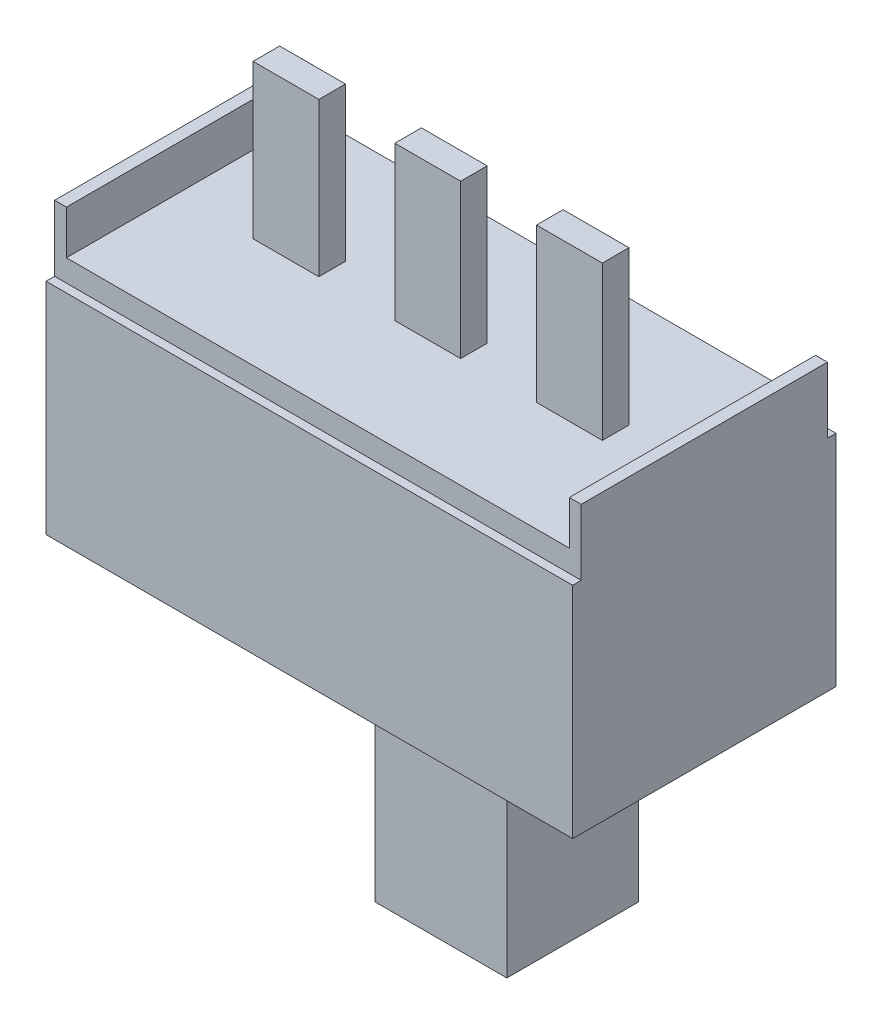
ISO-10303-21;
HEADER;
FILE_DESCRIPTION(('STEP AP214'),'2;1');
FILE_NAME('part.step','',(''),(''),'','','');
FILE_SCHEMA(('AUTOMOTIVE_DESIGN { 1 0 10303 214 1 1 1 1 }'));
ENDSEC;
DATA;
#1=APPLICATION_CONTEXT('core data for automotive mechanical design processes');
#2=APPLICATION_PROTOCOL_DEFINITION('international standard','automotive_design',2000,#1);
#3=PRODUCT_CONTEXT('',#1,'mechanical');
#4=PRODUCT('Part','Part','',(#3));
#5=PRODUCT_RELATED_PRODUCT_CATEGORY('part','',(#4));
#6=PRODUCT_DEFINITION_FORMATION('','',#4);
#7=PRODUCT_DEFINITION_CONTEXT('part definition',#1,'design');
#8=PRODUCT_DEFINITION('design','',#6,#7);
#9=PRODUCT_DEFINITION_SHAPE('','',#8);
#10=(LENGTH_UNIT() NAMED_UNIT(*) SI_UNIT(.MILLI.,.METRE.));
#11=(NAMED_UNIT(*) PLANE_ANGLE_UNIT() SI_UNIT($,.RADIAN.));
#12=(NAMED_UNIT(*) SI_UNIT($,.STERADIAN.) SOLID_ANGLE_UNIT());
#13=UNCERTAINTY_MEASURE_WITH_UNIT(LENGTH_MEASURE(1.E-05),#10,'distance_accuracy_value','');
#14=(GEOMETRIC_REPRESENTATION_CONTEXT(3) GLOBAL_UNCERTAINTY_ASSIGNED_CONTEXT((#13)) GLOBAL_UNIT_ASSIGNED_CONTEXT((#10,
#11,#12)) REPRESENTATION_CONTEXT('',''));
#15=CARTESIAN_POINT('',(0.,0.,0.));
#16=DIRECTION('',(0.,0.,1.));
#17=DIRECTION('',(1.,0.,0.));
#18=AXIS2_PLACEMENT_3D('',#15,#16,#17);
#19=CARTESIAN_POINT('',(3.,5.,1.5));
#20=DIRECTION('',(0.,0.,-1.));
#21=DIRECTION('',(-1.,0.,0.));
#22=AXIS2_PLACEMENT_3D('',#19,#20,#21);
#23=PLANE('',#22);
#24=DIRECTION('',(-1.,0.,0.));
#25=VECTOR('',#24,1.);
#26=CARTESIAN_POINT('',(3.,0.5,1.5));
#27=LINE('',#26,#25);
#28=CARTESIAN_POINT('',(0.,0.5,1.5));
#29=VERTEX_POINT('',#28);
#30=CARTESIAN_POINT('',(-3.,0.5,1.5));
#31=VERTEX_POINT('',#30);
#32=EDGE_CURVE('E62',#29,#31,#27,.T.);
#33=ORIENTED_EDGE('',*,*,#32,.F.);
#34=DIRECTION('',(0.,1.,0.));
#35=VECTOR('',#34,1.);
#36=CARTESIAN_POINT('',(0.,-5.,1.5));
#37=LINE('',#36,#35);
#38=CARTESIAN_POINT('',(0.,0.,1.5));
#39=VERTEX_POINT('',#38);
#40=EDGE_CURVE('E55',#39,#29,#37,.T.);
#41=ORIENTED_EDGE('',*,*,#40,.F.);
#42=DIRECTION('',(1.,0.,0.));
#43=VECTOR('',#42,1.);
#44=CARTESIAN_POINT('',(3.,0.,1.5));
#45=LINE('',#44,#43);
#46=CARTESIAN_POINT('',(-3.,0.,1.5));
#47=VERTEX_POINT('',#46);
#48=EDGE_CURVE('E505',#47,#39,#45,.T.);
#49=ORIENTED_EDGE('',*,*,#48,.F.);
#50=DIRECTION('',(0.,-1.,0.));
#51=VECTOR('',#50,1.);
#52=CARTESIAN_POINT('',(-3.,5.,1.5));
#53=LINE('',#52,#51);
#54=EDGE_CURVE('E520',#31,#47,#53,.T.);
#55=ORIENTED_EDGE('',*,*,#54,.F.);
#56=EDGE_LOOP('',(#33,#41,#49,#55));
#57=FACE_BOUND('',#56,.T.);
#58=ADVANCED_FACE('F39',(#57),#23,.T.);
#59=CARTESIAN_POINT('',(3.,5.,-1.5));
#60=DIRECTION('',(0.,0.,1.));
#61=DIRECTION('',(1.,0.,0.));
#62=AXIS2_PLACEMENT_3D('',#59,#60,#61);
#63=PLANE('',#62);
#64=DIRECTION('',(-1.,0.,0.));
#65=VECTOR('',#64,1.);
#66=CARTESIAN_POINT('',(3.,0.,-1.5));
#67=LINE('',#66,#65);
#68=CARTESIAN_POINT('',(0.,0.,-1.5));
#69=VERTEX_POINT('',#68);
#70=CARTESIAN_POINT('',(-3.,0.,-1.5));
#71=VERTEX_POINT('',#70);
#72=EDGE_CURVE('E511',#69,#71,#67,.T.);
#73=ORIENTED_EDGE('',*,*,#72,.F.);
#74=DIRECTION('',(0.,1.,0.));
#75=VECTOR('',#74,1.);
#76=CARTESIAN_POINT('',(0.,-5.,-1.5));
#77=LINE('',#76,#75);
#78=CARTESIAN_POINT('',(0.,0.5,-1.5));
#79=VERTEX_POINT('',#78);
#80=EDGE_CURVE('E614',#69,#79,#77,.T.);
#81=ORIENTED_EDGE('',*,*,#80,.T.);
#82=DIRECTION('',(1.,0.,0.));
#83=VECTOR('',#82,1.);
#84=CARTESIAN_POINT('',(-3.,0.5,-1.5));
#85=LINE('',#84,#83);
#86=CARTESIAN_POINT('',(-3.,0.5,-1.5));
#87=VERTEX_POINT('',#86);
#88=EDGE_CURVE('E285',#87,#79,#85,.T.);
#89=ORIENTED_EDGE('',*,*,#88,.F.);
#90=DIRECTION('',(0.,-1.,0.));
#91=VECTOR('',#90,1.);
#92=CARTESIAN_POINT('',(-3.,5.,-1.5));
#93=LINE('',#92,#91);
#94=EDGE_CURVE('E516',#87,#71,#93,.T.);
#95=ORIENTED_EDGE('',*,*,#94,.T.);
#96=EDGE_LOOP('',(#73,#81,#89,#95));
#97=FACE_BOUND('',#96,.T.);
#98=ADVANCED_FACE('F595',(#97),#63,.T.);
#99=CARTESIAN_POINT('',(0.,0.5,0.));
#100=DIRECTION('',(0.,-1.,0.));
#101=DIRECTION('',(0.,0.,-1.));
#102=AXIS2_PLACEMENT_3D('',#99,#100,#101);
#103=PLANE('',#102);
#104=ORIENTED_EDGE('',*,*,#88,.T.);
#105=DIRECTION('',(0.,0.,-1.));
#106=VECTOR('',#105,1.);
#107=CARTESIAN_POINT('',(0.,0.5,1.5));
#108=LINE('',#107,#106);
#109=EDGE_CURVE('E266',#29,#79,#108,.T.);
#110=ORIENTED_EDGE('',*,*,#109,.F.);
#111=ORIENTED_EDGE('',*,*,#32,.T.);
#112=DIRECTION('',(0.,0.,-1.));
#113=VECTOR('',#112,1.);
#114=CARTESIAN_POINT('',(-3.,0.5,1.5));
#115=LINE('',#114,#113);
#116=EDGE_CURVE('E282',#31,#87,#115,.T.);
#117=ORIENTED_EDGE('',*,*,#116,.T.);
#118=EDGE_LOOP('',(#104,#110,#111,#117));
#119=FACE_BOUND('',#118,.T.);
#120=ADVANCED_FACE('F619',(#119),#103,.T.);
#121=CARTESIAN_POINT('',(0.,5.,0.));
#122=DIRECTION('',(0.,1.,0.));
#123=DIRECTION('',(0.,0.,1.));
#124=AXIS2_PLACEMENT_3D('',#121,#122,#123);
#125=PLANE('',#124);
#126=DIRECTION('',(0.,0.,-1.));
#127=VECTOR('',#126,1.);
#128=CARTESIAN_POINT('',(6.,5.,3.));
#129=LINE('',#128,#127);
#130=CARTESIAN_POINT('',(6.,5.,3.));
#131=VERTEX_POINT('',#130);
#132=CARTESIAN_POINT('',(6.,5.,2.8051113903814));
#133=VERTEX_POINT('',#132);
#134=EDGE_CURVE('E533',#131,#133,#129,.T.);
#135=ORIENTED_EDGE('',*,*,#134,.T.);
#136=DIRECTION('',(-1.,0.,0.));
#137=VECTOR('',#136,1.);
#138=CARTESIAN_POINT('',(0.,5.,2.8051113903814));
#139=LINE('',#138,#137);
#140=CARTESIAN_POINT('',(-6.,5.,2.8051113903814));
#141=VERTEX_POINT('',#140);
#142=EDGE_CURVE('E438',#133,#141,#139,.T.);
#143=ORIENTED_EDGE('',*,*,#142,.T.);
#144=DIRECTION('',(0.,0.,1.));
#145=VECTOR('',#144,1.);
#146=CARTESIAN_POINT('',(-6.,5.,3.));
#147=LINE('',#146,#145);
#148=CARTESIAN_POINT('',(-6.,5.,3.));
#149=VERTEX_POINT('',#148);
#150=EDGE_CURVE('E529',#141,#149,#147,.T.);
#151=ORIENTED_EDGE('',*,*,#150,.T.);
#152=DIRECTION('',(1.,0.,0.));
#153=VECTOR('',#152,1.);
#154=CARTESIAN_POINT('',(6.,5.,3.));
#155=LINE('',#154,#153);
#156=EDGE_CURVE('E528',#149,#131,#155,.T.);
#157=ORIENTED_EDGE('',*,*,#156,.T.);
#158=EDGE_LOOP('',(#135,#143,#151,#157));
#159=FACE_BOUND('',#158,.T.);
#160=ADVANCED_FACE('F621',(#159),#125,.T.);
#161=DIRECTION('',(-1.,0.,0.));
#162=VECTOR('',#161,1.);
#163=CARTESIAN_POINT('',(0.,5.,-2.8051113903814));
#164=LINE('',#163,#162);
#165=CARTESIAN_POINT('',(6.,5.,-2.8051113903814));
#166=VERTEX_POINT('',#165);
#167=CARTESIAN_POINT('',(-6.,5.,-2.8051113903814));
#168=VERTEX_POINT('',#167);
#169=EDGE_CURVE('E444',#166,#168,#164,.T.);
#170=ORIENTED_EDGE('',*,*,#169,.F.);
#171=CARTESIAN_POINT('',(6.,5.,-3.));
#172=VERTEX_POINT('',#171);
#173=EDGE_CURVE('E532',#166,#172,#129,.T.);
#174=ORIENTED_EDGE('',*,*,#173,.T.);
#175=DIRECTION('',(-1.,0.,0.));
#176=VECTOR('',#175,1.);
#177=CARTESIAN_POINT('',(6.,5.,-3.));
#178=LINE('',#177,#176);
#179=CARTESIAN_POINT('',(-6.,5.,-3.));
#180=VERTEX_POINT('',#179);
#181=EDGE_CURVE('E537',#172,#180,#178,.T.);
#182=ORIENTED_EDGE('',*,*,#181,.T.);
#183=EDGE_CURVE('E524',#180,#168,#147,.T.);
#184=ORIENTED_EDGE('',*,*,#183,.T.);
#185=EDGE_LOOP('',(#170,#174,#182,#184));
#186=FACE_BOUND('',#185,.T.);
#187=ADVANCED_FACE('F584',(#186),#125,.T.);
#188=CARTESIAN_POINT('',(0.,0.,0.));
#189=DIRECTION('',(0.,1.,0.));
#190=DIRECTION('',(0.,0.,1.));
#191=AXIS2_PLACEMENT_3D('',#188,#189,#190);
#192=PLANE('',#191);
#193=DIRECTION('',(0.,0.,1.));
#194=VECTOR('',#193,1.);
#195=CARTESIAN_POINT('',(-6.,0.,3.));
#196=LINE('',#195,#194);
#197=CARTESIAN_POINT('',(-6.,0.,-3.));
#198=VERTEX_POINT('',#197);
#199=CARTESIAN_POINT('',(-6.,0.,3.));
#200=VERTEX_POINT('',#199);
#201=EDGE_CURVE('E523',#198,#200,#196,.T.);
#202=ORIENTED_EDGE('',*,*,#201,.F.);
#203=DIRECTION('',(-1.,0.,0.));
#204=VECTOR('',#203,1.);
#205=CARTESIAN_POINT('',(6.,0.,-3.));
#206=LINE('',#205,#204);
#207=CARTESIAN_POINT('',(6.,0.,-3.));
#208=VERTEX_POINT('',#207);
#209=EDGE_CURVE('E550',#208,#198,#206,.T.);
#210=ORIENTED_EDGE('',*,*,#209,.F.);
#211=DIRECTION('',(0.,0.,-1.));
#212=VECTOR('',#211,1.);
#213=CARTESIAN_POINT('',(6.,0.,3.));
#214=LINE('',#213,#212);
#215=CARTESIAN_POINT('',(6.,0.,3.));
#216=VERTEX_POINT('',#215);
#217=EDGE_CURVE('E547',#216,#208,#214,.T.);
#218=ORIENTED_EDGE('',*,*,#217,.F.);
#219=DIRECTION('',(1.,0.,0.));
#220=VECTOR('',#219,1.);
#221=CARTESIAN_POINT('',(6.,0.,3.));
#222=LINE('',#221,#220);
#223=EDGE_CURVE('E544',#200,#216,#222,.T.);
#224=ORIENTED_EDGE('',*,*,#223,.F.);
#225=EDGE_LOOP('',(#202,#210,#218,#224));
#226=FACE_BOUND('',#225,.T.);
#227=DIRECTION('',(0.,0.,1.));
#228=VECTOR('',#227,1.);
#229=CARTESIAN_POINT('',(-3.,0.,1.5));
#230=LINE('',#229,#228);
#231=EDGE_CURVE('E497',#71,#47,#230,.T.);
#232=ORIENTED_EDGE('',*,*,#231,.T.);
#233=ORIENTED_EDGE('',*,*,#48,.T.);
#234=DIRECTION('',(-1.,0.,0.));
#235=VECTOR('',#234,1.);
#236=CARTESIAN_POINT('',(0.,0.,1.5));
#237=LINE('',#236,#235);
#238=CARTESIAN_POINT('',(3.,0.,1.5));
#239=VERTEX_POINT('',#238);
#240=EDGE_CURVE('E272',#239,#39,#237,.T.);
#241=ORIENTED_EDGE('',*,*,#240,.F.);
#242=DIRECTION('',(0.,0.,-1.));
#243=VECTOR('',#242,1.);
#244=CARTESIAN_POINT('',(3.,0.,1.5));
#245=LINE('',#244,#243);
#246=CARTESIAN_POINT('',(3.,0.,-1.5));
#247=VERTEX_POINT('',#246);
#248=EDGE_CURVE('E270',#239,#247,#245,.T.);
#249=ORIENTED_EDGE('',*,*,#248,.T.);
#250=EDGE_CURVE('E512',#247,#69,#67,.T.);
#251=ORIENTED_EDGE('',*,*,#250,.T.);
#252=ORIENTED_EDGE('',*,*,#72,.T.);
#253=EDGE_LOOP('',(#232,#233,#241,#249,#251,#252));
#254=FACE_BOUND('',#253,.T.);
#255=ADVANCED_FACE('F572',(#226,#254),#192,.F.);
#256=CARTESIAN_POINT('',(-6.,5.,3.));
#257=DIRECTION('',(1.,0.,0.));
#258=DIRECTION('',(0.,0.,-1.));
#259=AXIS2_PLACEMENT_3D('',#256,#257,#258);
#260=PLANE('',#259);
#261=ORIENTED_EDGE('',*,*,#201,.T.);
#262=DIRECTION('',(0.,-1.,0.));
#263=VECTOR('',#262,1.);
#264=CARTESIAN_POINT('',(-6.,5.,3.));
#265=LINE('',#264,#263);
#266=EDGE_CURVE('E11',#149,#200,#265,.T.);
#267=ORIENTED_EDGE('',*,*,#266,.F.);
#268=ORIENTED_EDGE('',*,*,#150,.F.);
#269=DIRECTION('',(0.,-1.,0.));
#270=VECTOR('',#269,1.);
#271=CARTESIAN_POINT('',(-6.,6.5,2.8051113903814));
#272=LINE('',#271,#270);
#273=CARTESIAN_POINT('',(-6.,6.5,2.8051113903814));
#274=VERTEX_POINT('',#273);
#275=EDGE_CURVE('E434',#274,#141,#272,.T.);
#276=ORIENTED_EDGE('',*,*,#275,.F.);
#277=DIRECTION('',(0.,0.,1.));
#278=VECTOR('',#277,1.);
#279=CARTESIAN_POINT('',(-6.,6.5,0.));
#280=LINE('',#279,#278);
#281=CARTESIAN_POINT('',(-6.,6.5,-2.8051113903814));
#282=VERTEX_POINT('',#281);
#283=EDGE_CURVE('E409',#282,#274,#280,.T.);
#284=ORIENTED_EDGE('',*,*,#283,.F.);
#285=DIRECTION('',(0.,-1.,0.));
#286=VECTOR('',#285,1.);
#287=CARTESIAN_POINT('',(-6.,6.5,-2.8051113903814));
#288=LINE('',#287,#286);
#289=EDGE_CURVE('E422',#282,#168,#288,.T.);
#290=ORIENTED_EDGE('',*,*,#289,.T.);
#291=ORIENTED_EDGE('',*,*,#183,.F.);
#292=DIRECTION('',(0.,-1.,0.));
#293=VECTOR('',#292,1.);
#294=CARTESIAN_POINT('',(-6.,5.,-3.));
#295=LINE('',#294,#293);
#296=EDGE_CURVE('E540',#180,#198,#295,.T.);
#297=ORIENTED_EDGE('',*,*,#296,.T.);
#298=EDGE_LOOP('',(#261,#267,#268,#276,#284,#290,#291,#297));
#299=FACE_BOUND('',#298,.T.);
#300=ADVANCED_FACE('F41',(#299),#260,.F.);
#301=CARTESIAN_POINT('',(6.,5.,3.));
#302=DIRECTION('',(0.,0.,-1.));
#303=DIRECTION('',(-1.,0.,0.));
#304=AXIS2_PLACEMENT_3D('',#301,#302,#303);
#305=PLANE('',#304);
#306=ORIENTED_EDGE('',*,*,#223,.T.);
#307=DIRECTION('',(0.,-1.,0.));
#308=VECTOR('',#307,1.);
#309=CARTESIAN_POINT('',(6.,5.,3.));
#310=LINE('',#309,#308);
#311=EDGE_CURVE('E48',#131,#216,#310,.T.);
#312=ORIENTED_EDGE('',*,*,#311,.F.);
#313=ORIENTED_EDGE('',*,*,#156,.F.);
#314=ORIENTED_EDGE('',*,*,#266,.T.);
#315=EDGE_LOOP('',(#306,#312,#313,#314));
#316=FACE_BOUND('',#315,.T.);
#317=ADVANCED_FACE('F646',(#316),#305,.F.);
#318=CARTESIAN_POINT('',(6.,5.,3.));
#319=DIRECTION('',(-1.,0.,0.));
#320=DIRECTION('',(0.,0.,1.));
#321=AXIS2_PLACEMENT_3D('',#318,#319,#320);
#322=PLANE('',#321);
#323=ORIENTED_EDGE('',*,*,#217,.T.);
#324=DIRECTION('',(0.,-1.,0.));
#325=VECTOR('',#324,1.);
#326=CARTESIAN_POINT('',(6.,5.,-3.));
#327=LINE('',#326,#325);
#328=EDGE_CURVE('E556',#172,#208,#327,.T.);
#329=ORIENTED_EDGE('',*,*,#328,.F.);
#330=ORIENTED_EDGE('',*,*,#173,.F.);
#331=DIRECTION('',(0.,-1.,0.));
#332=VECTOR('',#331,1.);
#333=CARTESIAN_POINT('',(6.,6.5,-2.8051113903814));
#334=LINE('',#333,#332);
#335=CARTESIAN_POINT('',(6.,6.5,-2.8051113903814));
#336=VERTEX_POINT('',#335);
#337=EDGE_CURVE('E401',#336,#166,#334,.T.);
#338=ORIENTED_EDGE('',*,*,#337,.F.);
#339=DIRECTION('',(0.,0.,-1.));
#340=VECTOR('',#339,1.);
#341=CARTESIAN_POINT('',(6.,6.5,0.));
#342=LINE('',#341,#340);
#343=CARTESIAN_POINT('',(6.,6.5,2.8051113903814));
#344=VERTEX_POINT('',#343);
#345=EDGE_CURVE('E383',#344,#336,#342,.T.);
#346=ORIENTED_EDGE('',*,*,#345,.F.);
#347=DIRECTION('',(0.,-1.,0.));
#348=VECTOR('',#347,1.);
#349=CARTESIAN_POINT('',(6.,6.5,2.8051113903814));
#350=LINE('',#349,#348);
#351=EDGE_CURVE('E405',#344,#133,#350,.T.);
#352=ORIENTED_EDGE('',*,*,#351,.T.);
#353=ORIENTED_EDGE('',*,*,#134,.F.);
#354=ORIENTED_EDGE('',*,*,#311,.T.);
#355=EDGE_LOOP('',(#323,#329,#330,#338,#346,#352,#353,#354));
#356=FACE_BOUND('',#355,.T.);
#357=ADVANCED_FACE('F565',(#356),#322,.F.);
#358=CARTESIAN_POINT('',(6.,5.,-3.));
#359=DIRECTION('',(0.,0.,1.));
#360=DIRECTION('',(1.,0.,0.));
#361=AXIS2_PLACEMENT_3D('',#358,#359,#360);
#362=PLANE('',#361);
#363=ORIENTED_EDGE('',*,*,#209,.T.);
#364=ORIENTED_EDGE('',*,*,#296,.F.);
#365=ORIENTED_EDGE('',*,*,#181,.F.);
#366=ORIENTED_EDGE('',*,*,#328,.T.);
#367=EDGE_LOOP('',(#363,#364,#365,#366));
#368=FACE_BOUND('',#367,.T.);
#369=ADVANCED_FACE('F576',(#368),#362,.F.);
#370=CARTESIAN_POINT('',(-3.,5.,1.5));
#371=DIRECTION('',(1.,0.,0.));
#372=DIRECTION('',(0.,0.,-1.));
#373=AXIS2_PLACEMENT_3D('',#370,#371,#372);
#374=PLANE('',#373);
#375=ORIENTED_EDGE('',*,*,#116,.F.);
#376=ORIENTED_EDGE('',*,*,#54,.T.);
#377=ORIENTED_EDGE('',*,*,#231,.F.);
#378=ORIENTED_EDGE('',*,*,#94,.F.);
#379=EDGE_LOOP('',(#375,#376,#377,#378));
#380=FACE_BOUND('',#379,.T.);
#381=ADVANCED_FACE('F597',(#380),#374,.T.);
#382=CARTESIAN_POINT('',(0.,5.5,2.8051113903814));
#383=DIRECTION('',(0.,0.,1.));
#384=DIRECTION('',(1.,0.,0.));
#385=AXIS2_PLACEMENT_3D('',#382,#383,#384);
#386=PLANE('',#385);
#387=ORIENTED_EDGE('',*,*,#142,.F.);
#388=ORIENTED_EDGE('',*,*,#351,.F.);
#389=DIRECTION('',(-1.,0.,0.));
#390=VECTOR('',#389,1.);
#391=CARTESIAN_POINT('',(0.,6.5,2.8051113903814));
#392=LINE('',#391,#390);
#393=CARTESIAN_POINT('',(5.73001401451571,6.5,2.8051113903814));
#394=VERTEX_POINT('',#393);
#395=EDGE_CURVE('E379',#344,#394,#392,.T.);
#396=ORIENTED_EDGE('',*,*,#395,.T.);
#397=DIRECTION('',(0.,-1.,0.));
#398=VECTOR('',#397,1.);
#399=CARTESIAN_POINT('',(5.73001401451571,6.5,2.8051113903814));
#400=LINE('',#399,#398);
#401=CARTESIAN_POINT('',(5.73001401451571,5.5,2.8051113903814));
#402=VERTEX_POINT('',#401);
#403=EDGE_CURVE('E394',#394,#402,#400,.T.);
#404=ORIENTED_EDGE('',*,*,#403,.T.);
#405=DIRECTION('',(-1.,0.,0.));
#406=VECTOR('',#405,1.);
#407=CARTESIAN_POINT('',(0.,5.5,2.8051113903814));
#408=LINE('',#407,#406);
#409=CARTESIAN_POINT('',(-5.73001401451571,5.5,2.8051113903814));
#410=VERTEX_POINT('',#409);
#411=EDGE_CURVE('E458',#402,#410,#408,.T.);
#412=ORIENTED_EDGE('',*,*,#411,.T.);
#413=DIRECTION('',(0.,-1.,0.));
#414=VECTOR('',#413,1.);
#415=CARTESIAN_POINT('',(-5.73001401451571,6.5,2.8051113903814));
#416=LINE('',#415,#414);
#417=CARTESIAN_POINT('',(-5.73001401451571,6.5,2.8051113903814));
#418=VERTEX_POINT('',#417);
#419=EDGE_CURVE('E430',#418,#410,#416,.T.);
#420=ORIENTED_EDGE('',*,*,#419,.F.);
#421=DIRECTION('',(1.,0.,0.));
#422=VECTOR('',#421,1.);
#423=CARTESIAN_POINT('',(0.,6.5,2.8051113903814));
#424=LINE('',#423,#422);
#425=EDGE_CURVE('E413',#274,#418,#424,.T.);
#426=ORIENTED_EDGE('',*,*,#425,.F.);
#427=ORIENTED_EDGE('',*,*,#275,.T.);
#428=EDGE_LOOP('',(#387,#388,#396,#404,#412,#420,#426,#427));
#429=FACE_BOUND('',#428,.T.);
#430=ADVANCED_FACE('F639',(#429),#386,.T.);
#431=CARTESIAN_POINT('',(0.,5.5,-2.8051113903814));
#432=DIRECTION('',(0.,0.,1.));
#433=DIRECTION('',(1.,0.,0.));
#434=AXIS2_PLACEMENT_3D('',#431,#432,#433);
#435=PLANE('',#434);
#436=ORIENTED_EDGE('',*,*,#169,.T.);
#437=ORIENTED_EDGE('',*,*,#289,.F.);
#438=DIRECTION('',(-1.,0.,0.));
#439=VECTOR('',#438,1.);
#440=CARTESIAN_POINT('',(0.,6.5,-2.8051113903814));
#441=LINE('',#440,#439);
#442=CARTESIAN_POINT('',(-5.73001401451571,6.5,-2.8051113903814));
#443=VERTEX_POINT('',#442);
#444=EDGE_CURVE('E419',#443,#282,#441,.T.);
#445=ORIENTED_EDGE('',*,*,#444,.F.);
#446=DIRECTION('',(0.,-1.,0.));
#447=VECTOR('',#446,1.);
#448=CARTESIAN_POINT('',(-5.73001401451571,6.5,-2.8051113903814));
#449=LINE('',#448,#447);
#450=CARTESIAN_POINT('',(-5.73001401451571,5.5,-2.8051113903814));
#451=VERTEX_POINT('',#450);
#452=EDGE_CURVE('E426',#443,#451,#449,.T.);
#453=ORIENTED_EDGE('',*,*,#452,.T.);
#454=DIRECTION('',(-1.,0.,0.));
#455=VECTOR('',#454,1.);
#456=CARTESIAN_POINT('',(0.,5.5,-2.8051113903814));
#457=LINE('',#456,#455);
#458=CARTESIAN_POINT('',(5.73001401451571,5.5,-2.8051113903814));
#459=VERTEX_POINT('',#458);
#460=EDGE_CURVE('E466',#459,#451,#457,.T.);
#461=ORIENTED_EDGE('',*,*,#460,.F.);
#462=DIRECTION('',(0.,-1.,0.));
#463=VECTOR('',#462,1.);
#464=CARTESIAN_POINT('',(5.73001401451571,6.5,-2.8051113903814));
#465=LINE('',#464,#463);
#466=CARTESIAN_POINT('',(5.73001401451571,6.5,-2.8051113903814));
#467=VERTEX_POINT('',#466);
#468=EDGE_CURVE('E398',#467,#459,#465,.T.);
#469=ORIENTED_EDGE('',*,*,#468,.F.);
#470=DIRECTION('',(1.,0.,0.));
#471=VECTOR('',#470,1.);
#472=CARTESIAN_POINT('',(0.,6.5,-2.8051113903814));
#473=LINE('',#472,#471);
#474=EDGE_CURVE('E386',#467,#336,#473,.T.);
#475=ORIENTED_EDGE('',*,*,#474,.T.);
#476=ORIENTED_EDGE('',*,*,#337,.T.);
#477=EDGE_LOOP('',(#436,#437,#445,#453,#461,#469,#475,#476));
#478=FACE_BOUND('',#477,.T.);
#479=ADVANCED_FACE('F661',(#478),#435,.F.);
#480=CARTESIAN_POINT('',(0.,5.5,0.));
#481=DIRECTION('',(0.,1.,0.));
#482=DIRECTION('',(0.,0.,1.));
#483=AXIS2_PLACEMENT_3D('',#480,#481,#482);
#484=PLANE('',#483);
#485=DIRECTION('',(0.,0.,-1.));
#486=VECTOR('',#485,1.);
#487=CARTESIAN_POINT('',(2.48001401451571,5.5,0.));
#488=LINE('',#487,#486);
#489=CARTESIAN_POINT('',(2.48001401451571,5.5,0.303180021633457));
#490=VERTEX_POINT('',#489);
#491=CARTESIAN_POINT('',(2.48001401451571,5.5,-0.303180021633457));
#492=VERTEX_POINT('',#491);
#493=EDGE_CURVE('E439',#490,#492,#488,.T.);
#494=ORIENTED_EDGE('',*,*,#493,.T.);
#495=DIRECTION('',(1.,0.,0.));
#496=VECTOR('',#495,1.);
#497=CARTESIAN_POINT('',(0.,5.5,-0.303180021633457));
#498=LINE('',#497,#496);
#499=CARTESIAN_POINT('',(3.98001401451571,5.5,-0.303180021633457));
#500=VERTEX_POINT('',#499);
#501=EDGE_CURVE('E443',#492,#500,#498,.T.);
#502=ORIENTED_EDGE('',*,*,#501,.T.);
#503=DIRECTION('',(0.,0.,-1.));
#504=VECTOR('',#503,1.);
#505=CARTESIAN_POINT('',(3.98001401451571,5.5,0.));
#506=LINE('',#505,#504);
#507=CARTESIAN_POINT('',(3.98001401451571,5.5,0.303180021633457));
#508=VERTEX_POINT('',#507);
#509=EDGE_CURVE('E448',#508,#500,#506,.T.);
#510=ORIENTED_EDGE('',*,*,#509,.F.);
#511=DIRECTION('',(1.,0.,0.));
#512=VECTOR('',#511,1.);
#513=CARTESIAN_POINT('',(0.,5.5,0.303180021633457));
#514=LINE('',#513,#512);
#515=EDGE_CURVE('E451',#490,#508,#514,.T.);
#516=ORIENTED_EDGE('',*,*,#515,.F.);
#517=EDGE_LOOP('',(#494,#502,#510,#516));
#518=FACE_BOUND('',#517,.T.);
#519=DIRECTION('',(0.,0.,-1.));
#520=VECTOR('',#519,1.);
#521=CARTESIAN_POINT('',(-5.73001401451571,5.5,0.));
#522=LINE('',#521,#520);
#523=EDGE_CURVE('E454',#410,#451,#522,.T.);
#524=ORIENTED_EDGE('',*,*,#523,.F.);
#525=ORIENTED_EDGE('',*,*,#411,.F.);
#526=DIRECTION('',(0.,0.,-1.));
#527=VECTOR('',#526,1.);
#528=CARTESIAN_POINT('',(5.73001401451571,5.5,0.));
#529=LINE('',#528,#527);
#530=EDGE_CURVE('E462',#402,#459,#529,.T.);
#531=ORIENTED_EDGE('',*,*,#530,.T.);
#532=ORIENTED_EDGE('',*,*,#460,.T.);
#533=EDGE_LOOP('',(#524,#525,#531,#532));
#534=FACE_BOUND('',#533,.T.);
#535=DIRECTION('',(-1.,0.,0.));
#536=VECTOR('',#535,1.);
#537=CARTESIAN_POINT('',(0.,5.5,0.303180021633457));
#538=LINE('',#537,#536);
#539=CARTESIAN_POINT('',(-2.48001401451571,5.5,0.303180021633457));
#540=VERTEX_POINT('',#539);
#541=CARTESIAN_POINT('',(-3.98001401451571,5.5,0.303180021633457));
#542=VERTEX_POINT('',#541);
#543=EDGE_CURVE('E469',#540,#542,#538,.T.);
#544=ORIENTED_EDGE('',*,*,#543,.T.);
#545=DIRECTION('',(0.,0.,-1.));
#546=VECTOR('',#545,1.);
#547=CARTESIAN_POINT('',(-3.98001401451571,5.5,0.));
#548=LINE('',#547,#546);
#549=CARTESIAN_POINT('',(-3.98001401451571,5.5,-0.303180021633457));
#550=VERTEX_POINT('',#549);
#551=EDGE_CURVE('E473',#542,#550,#548,.T.);
#552=ORIENTED_EDGE('',*,*,#551,.T.);
#553=DIRECTION('',(-1.,0.,0.));
#554=VECTOR('',#553,1.);
#555=CARTESIAN_POINT('',(0.,5.5,-0.303180021633457));
#556=LINE('',#555,#554);
#557=CARTESIAN_POINT('',(-2.48001401451571,5.5,-0.303180021633457));
#558=VERTEX_POINT('',#557);
#559=EDGE_CURVE('E477',#558,#550,#556,.T.);
#560=ORIENTED_EDGE('',*,*,#559,.F.);
#561=DIRECTION('',(0.,0.,-1.));
#562=VECTOR('',#561,1.);
#563=CARTESIAN_POINT('',(-2.48001401451571,5.5,0.));
#564=LINE('',#563,#562);
#565=EDGE_CURVE('E480',#540,#558,#564,.T.);
#566=ORIENTED_EDGE('',*,*,#565,.F.);
#567=EDGE_LOOP('',(#544,#552,#560,#566));
#568=FACE_BOUND('',#567,.T.);
#569=DIRECTION('',(0.,0.,-1.));
#570=VECTOR('',#569,1.);
#571=CARTESIAN_POINT('',(0.75,5.5,0.));
#572=LINE('',#571,#570);
#573=CARTESIAN_POINT('',(0.75,5.5,0.303180021633457));
#574=VERTEX_POINT('',#573);
#575=CARTESIAN_POINT('',(0.75,5.5,-0.303180021633457));
#576=VERTEX_POINT('',#575);
#577=EDGE_CURVE('E483',#574,#576,#572,.T.);
#578=ORIENTED_EDGE('',*,*,#577,.F.);
#579=DIRECTION('',(1.,0.,0.));
#580=VECTOR('',#579,1.);
#581=CARTESIAN_POINT('',(0.,5.5,0.303180021633457));
#582=LINE('',#581,#580);
#583=CARTESIAN_POINT('',(-0.75,5.5,0.303180021633457));
#584=VERTEX_POINT('',#583);
#585=EDGE_CURVE('E486',#584,#574,#582,.T.);
#586=ORIENTED_EDGE('',*,*,#585,.F.);
#587=DIRECTION('',(0.,0.,-1.));
#588=VECTOR('',#587,1.);
#589=CARTESIAN_POINT('',(-0.75,5.5,0.));
#590=LINE('',#589,#588);
#591=CARTESIAN_POINT('',(-0.75,5.5,-0.303180021633457));
#592=VERTEX_POINT('',#591);
#593=EDGE_CURVE('E489',#584,#592,#590,.T.);
#594=ORIENTED_EDGE('',*,*,#593,.T.);
#595=DIRECTION('',(1.,0.,0.));
#596=VECTOR('',#595,1.);
#597=CARTESIAN_POINT('',(0.,5.5,-0.303180021633457));
#598=LINE('',#597,#596);
#599=EDGE_CURVE('E493',#592,#576,#598,.T.);
#600=ORIENTED_EDGE('',*,*,#599,.T.);
#601=EDGE_LOOP('',(#578,#586,#594,#600));
#602=FACE_BOUND('',#601,.T.);
#603=ADVANCED_FACE('F671',(#518,#534,#568,#602),#484,.T.);
#604=CARTESIAN_POINT('',(-5.73001401451571,6.5,0.));
#605=DIRECTION('',(-1.,0.,0.));
#606=DIRECTION('',(0.,0.,1.));
#607=AXIS2_PLACEMENT_3D('',#604,#605,#606);
#608=PLANE('',#607);
#609=ORIENTED_EDGE('',*,*,#523,.T.);
#610=ORIENTED_EDGE('',*,*,#452,.F.);
#611=DIRECTION('',(0.,0.,-1.));
#612=VECTOR('',#611,1.);
#613=CARTESIAN_POINT('',(-5.73001401451571,6.5,0.));
#614=LINE('',#613,#612);
#615=EDGE_CURVE('E416',#418,#443,#614,.T.);
#616=ORIENTED_EDGE('',*,*,#615,.F.);
#617=ORIENTED_EDGE('',*,*,#419,.T.);
#618=EDGE_LOOP('',(#609,#610,#616,#617));
#619=FACE_BOUND('',#618,.T.);
#620=ADVANCED_FACE('F675',(#619),#608,.F.);
#621=CARTESIAN_POINT('',(0.,6.5,0.));
#622=DIRECTION('',(0.,1.,0.));
#623=DIRECTION('',(0.,0.,1.));
#624=AXIS2_PLACEMENT_3D('',#621,#622,#623);
#625=PLANE('',#624);
#626=ORIENTED_EDGE('',*,*,#283,.T.);
#627=ORIENTED_EDGE('',*,*,#425,.T.);
#628=ORIENTED_EDGE('',*,*,#615,.T.);
#629=ORIENTED_EDGE('',*,*,#444,.T.);
#630=EDGE_LOOP('',(#626,#627,#628,#629));
#631=FACE_BOUND('',#630,.T.);
#632=ADVANCED_FACE('F657',(#631),#625,.T.);
#633=CARTESIAN_POINT('',(5.73001401451571,6.5,0.));
#634=DIRECTION('',(-1.,0.,0.));
#635=DIRECTION('',(0.,0.,1.));
#636=AXIS2_PLACEMENT_3D('',#633,#634,#635);
#637=PLANE('',#636);
#638=ORIENTED_EDGE('',*,*,#468,.T.);
#639=ORIENTED_EDGE('',*,*,#530,.F.);
#640=ORIENTED_EDGE('',*,*,#403,.F.);
#641=DIRECTION('',(0.,0.,-1.));
#642=VECTOR('',#641,1.);
#643=CARTESIAN_POINT('',(5.73001401451571,6.5,0.));
#644=LINE('',#643,#642);
#645=EDGE_CURVE('E390',#394,#467,#644,.T.);
#646=ORIENTED_EDGE('',*,*,#645,.T.);
#647=EDGE_LOOP('',(#638,#639,#640,#646));
#648=FACE_BOUND('',#647,.T.);
#649=ADVANCED_FACE('F676',(#648),#637,.T.);
#650=CARTESIAN_POINT('',(0.,6.5,0.));
#651=DIRECTION('',(0.,1.,0.));
#652=DIRECTION('',(0.,0.,1.));
#653=AXIS2_PLACEMENT_3D('',#650,#651,#652);
#654=PLANE('',#653);
#655=ORIENTED_EDGE('',*,*,#395,.F.);
#656=ORIENTED_EDGE('',*,*,#345,.T.);
#657=ORIENTED_EDGE('',*,*,#474,.F.);
#658=ORIENTED_EDGE('',*,*,#645,.F.);
#659=EDGE_LOOP('',(#655,#656,#657,#658));
#660=FACE_BOUND('',#659,.T.);
#661=ADVANCED_FACE('F667',(#660),#654,.T.);
#662=CARTESIAN_POINT('',(0.,9.,0.303180021633457));
#663=DIRECTION('',(0.,0.,-1.));
#664=DIRECTION('',(-1.,0.,0.));
#665=AXIS2_PLACEMENT_3D('',#662,#663,#664);
#666=PLANE('',#665);
#667=ORIENTED_EDGE('',*,*,#515,.T.);
#668=DIRECTION('',(0.,-1.,0.));
#669=VECTOR('',#668,1.);
#670=CARTESIAN_POINT('',(3.98001401451571,9.,0.303180021633457));
#671=LINE('',#670,#669);
#672=CARTESIAN_POINT('',(3.98001401451571,9.,0.303180021633457));
#673=VERTEX_POINT('',#672);
#674=EDGE_CURVE('E375',#673,#508,#671,.T.);
#675=ORIENTED_EDGE('',*,*,#674,.F.);
#676=DIRECTION('',(1.,0.,0.));
#677=VECTOR('',#676,1.);
#678=CARTESIAN_POINT('',(0.,9.,0.303180021633457));
#679=LINE('',#678,#677);
#680=CARTESIAN_POINT('',(2.48001401451571,9.,0.303180021633457));
#681=VERTEX_POINT('',#680);
#682=EDGE_CURVE('E349',#681,#673,#679,.T.);
#683=ORIENTED_EDGE('',*,*,#682,.F.);
#684=DIRECTION('',(0.,-1.,0.));
#685=VECTOR('',#684,1.);
#686=CARTESIAN_POINT('',(2.48001401451571,9.,0.303180021633457));
#687=LINE('',#686,#685);
#688=EDGE_CURVE('E364',#681,#490,#687,.T.);
#689=ORIENTED_EDGE('',*,*,#688,.T.);
#690=EDGE_LOOP('',(#667,#675,#683,#689));
#691=FACE_BOUND('',#690,.T.);
#692=ADVANCED_FACE('F683',(#691),#666,.F.);
#693=CARTESIAN_POINT('',(3.98001401451571,9.,0.));
#694=DIRECTION('',(-1.,0.,0.));
#695=DIRECTION('',(0.,0.,1.));
#696=AXIS2_PLACEMENT_3D('',#693,#694,#695);
#697=PLANE('',#696);
#698=ORIENTED_EDGE('',*,*,#509,.T.);
#699=DIRECTION('',(0.,-1.,0.));
#700=VECTOR('',#699,1.);
#701=CARTESIAN_POINT('',(3.98001401451571,9.,-0.303180021633457));
#702=LINE('',#701,#700);
#703=CARTESIAN_POINT('',(3.98001401451571,9.,-0.303180021633457));
#704=VERTEX_POINT('',#703);
#705=EDGE_CURVE('E371',#704,#500,#702,.T.);
#706=ORIENTED_EDGE('',*,*,#705,.F.);
#707=DIRECTION('',(0.,0.,-1.));
#708=VECTOR('',#707,1.);
#709=CARTESIAN_POINT('',(3.98001401451571,9.,0.));
#710=LINE('',#709,#708);
#711=EDGE_CURVE('E353',#673,#704,#710,.T.);
#712=ORIENTED_EDGE('',*,*,#711,.F.);
#713=ORIENTED_EDGE('',*,*,#674,.T.);
#714=EDGE_LOOP('',(#698,#706,#712,#713));
#715=FACE_BOUND('',#714,.T.);
#716=ADVANCED_FACE('F735',(#715),#697,.F.);
#717=CARTESIAN_POINT('',(0.,9.,-0.303180021633457));
#718=DIRECTION('',(0.,0.,-1.));
#719=DIRECTION('',(-1.,0.,0.));
#720=AXIS2_PLACEMENT_3D('',#717,#718,#719);
#721=PLANE('',#720);
#722=ORIENTED_EDGE('',*,*,#705,.T.);
#723=ORIENTED_EDGE('',*,*,#501,.F.);
#724=DIRECTION('',(0.,-1.,0.));
#725=VECTOR('',#724,1.);
#726=CARTESIAN_POINT('',(2.48001401451571,9.,-0.303180021633457));
#727=LINE('',#726,#725);
#728=CARTESIAN_POINT('',(2.48001401451571,9.,-0.303180021633457));
#729=VERTEX_POINT('',#728);
#730=EDGE_CURVE('E368',#729,#492,#727,.T.);
#731=ORIENTED_EDGE('',*,*,#730,.F.);
#732=DIRECTION('',(1.,0.,0.));
#733=VECTOR('',#732,1.);
#734=CARTESIAN_POINT('',(0.,9.,-0.303180021633457));
#735=LINE('',#734,#733);
#736=EDGE_CURVE('E356',#729,#704,#735,.T.);
#737=ORIENTED_EDGE('',*,*,#736,.T.);
#738=EDGE_LOOP('',(#722,#723,#731,#737));
#739=FACE_BOUND('',#738,.T.);
#740=ADVANCED_FACE('F741',(#739),#721,.T.);
#741=CARTESIAN_POINT('',(2.48001401451571,9.,0.));
#742=DIRECTION('',(-1.,0.,0.));
#743=DIRECTION('',(0.,0.,1.));
#744=AXIS2_PLACEMENT_3D('',#741,#742,#743);
#745=PLANE('',#744);
#746=ORIENTED_EDGE('',*,*,#730,.T.);
#747=ORIENTED_EDGE('',*,*,#493,.F.);
#748=ORIENTED_EDGE('',*,*,#688,.F.);
#749=DIRECTION('',(0.,0.,-1.));
#750=VECTOR('',#749,1.);
#751=CARTESIAN_POINT('',(2.48001401451571,9.,0.));
#752=LINE('',#751,#750);
#753=EDGE_CURVE('E360',#681,#729,#752,.T.);
#754=ORIENTED_EDGE('',*,*,#753,.T.);
#755=EDGE_LOOP('',(#746,#747,#748,#754));
#756=FACE_BOUND('',#755,.T.);
#757=ADVANCED_FACE('F749',(#756),#745,.T.);
#758=CARTESIAN_POINT('',(0.,9.,0.));
#759=DIRECTION('',(0.,1.,0.));
#760=DIRECTION('',(0.,0.,1.));
#761=AXIS2_PLACEMENT_3D('',#758,#759,#760);
#762=PLANE('',#761);
#763=ORIENTED_EDGE('',*,*,#682,.T.);
#764=ORIENTED_EDGE('',*,*,#711,.T.);
#765=ORIENTED_EDGE('',*,*,#736,.F.);
#766=ORIENTED_EDGE('',*,*,#753,.F.);
#767=EDGE_LOOP('',(#763,#764,#765,#766));
#768=FACE_BOUND('',#767,.T.);
#769=ADVANCED_FACE('F757',(#768),#762,.T.);
#770=CARTESIAN_POINT('',(0.,9.,0.303180021633457));
#771=DIRECTION('',(0.,0.,-1.));
#772=DIRECTION('',(-1.,0.,0.));
#773=AXIS2_PLACEMENT_3D('',#770,#771,#772);
#774=PLANE('',#773);
#775=ORIENTED_EDGE('',*,*,#585,.T.);
#776=DIRECTION('',(0.,-1.,0.));
#777=VECTOR('',#776,1.);
#778=CARTESIAN_POINT('',(0.75,9.,0.303180021633457));
#779=LINE('',#778,#777);
#780=CARTESIAN_POINT('',(0.75,9.,0.303180021633457));
#781=VERTEX_POINT('',#780);
#782=EDGE_CURVE('E345',#781,#574,#779,.T.);
#783=ORIENTED_EDGE('',*,*,#782,.F.);
#784=DIRECTION('',(1.,0.,0.));
#785=VECTOR('',#784,1.);
#786=CARTESIAN_POINT('',(0.,9.,0.303180021633457));
#787=LINE('',#786,#785);
#788=CARTESIAN_POINT('',(-0.75,9.,0.303180021633457));
#789=VERTEX_POINT('',#788);
#790=EDGE_CURVE('E319',#789,#781,#787,.T.);
#791=ORIENTED_EDGE('',*,*,#790,.F.);
#792=DIRECTION('',(0.,-1.,0.));
#793=VECTOR('',#792,1.);
#794=CARTESIAN_POINT('',(-0.75,9.,0.303180021633457));
#795=LINE('',#794,#793);
#796=EDGE_CURVE('E334',#789,#584,#795,.T.);
#797=ORIENTED_EDGE('',*,*,#796,.T.);
#798=EDGE_LOOP('',(#775,#783,#791,#797));
#799=FACE_BOUND('',#798,.T.);
#800=ADVANCED_FACE('F765',(#799),#774,.F.);
#801=CARTESIAN_POINT('',(0.75,9.,0.));
#802=DIRECTION('',(-1.,0.,0.));
#803=DIRECTION('',(0.,0.,1.));
#804=AXIS2_PLACEMENT_3D('',#801,#802,#803);
#805=PLANE('',#804);
#806=ORIENTED_EDGE('',*,*,#577,.T.);
#807=DIRECTION('',(0.,-1.,0.));
#808=VECTOR('',#807,1.);
#809=CARTESIAN_POINT('',(0.75,9.,-0.303180021633457));
#810=LINE('',#809,#808);
#811=CARTESIAN_POINT('',(0.75,9.,-0.303180021633457));
#812=VERTEX_POINT('',#811);
#813=EDGE_CURVE('E341',#812,#576,#810,.T.);
#814=ORIENTED_EDGE('',*,*,#813,.F.);
#815=DIRECTION('',(0.,0.,-1.));
#816=VECTOR('',#815,1.);
#817=CARTESIAN_POINT('',(0.75,9.,0.));
#818=LINE('',#817,#816);
#819=EDGE_CURVE('E323',#781,#812,#818,.T.);
#820=ORIENTED_EDGE('',*,*,#819,.F.);
#821=ORIENTED_EDGE('',*,*,#782,.T.);
#822=EDGE_LOOP('',(#806,#814,#820,#821));
#823=FACE_BOUND('',#822,.T.);
#824=ADVANCED_FACE('F773',(#823),#805,.F.);
#825=CARTESIAN_POINT('',(0.,9.,-0.303180021633457));
#826=DIRECTION('',(0.,0.,-1.));
#827=DIRECTION('',(-1.,0.,0.));
#828=AXIS2_PLACEMENT_3D('',#825,#826,#827);
#829=PLANE('',#828);
#830=ORIENTED_EDGE('',*,*,#813,.T.);
#831=ORIENTED_EDGE('',*,*,#599,.F.);
#832=DIRECTION('',(0.,-1.,0.));
#833=VECTOR('',#832,1.);
#834=CARTESIAN_POINT('',(-0.75,9.,-0.303180021633457));
#835=LINE('',#834,#833);
#836=CARTESIAN_POINT('',(-0.75,9.,-0.303180021633457));
#837=VERTEX_POINT('',#836);
#838=EDGE_CURVE('E338',#837,#592,#835,.T.);
#839=ORIENTED_EDGE('',*,*,#838,.F.);
#840=DIRECTION('',(1.,0.,0.));
#841=VECTOR('',#840,1.);
#842=CARTESIAN_POINT('',(0.,9.,-0.303180021633457));
#843=LINE('',#842,#841);
#844=EDGE_CURVE('E326',#837,#812,#843,.T.);
#845=ORIENTED_EDGE('',*,*,#844,.T.);
#846=EDGE_LOOP('',(#830,#831,#839,#845));
#847=FACE_BOUND('',#846,.T.);
#848=ADVANCED_FACE('F781',(#847),#829,.T.);
#849=CARTESIAN_POINT('',(-0.75,9.,0.));
#850=DIRECTION('',(-1.,0.,0.));
#851=DIRECTION('',(0.,0.,1.));
#852=AXIS2_PLACEMENT_3D('',#849,#850,#851);
#853=PLANE('',#852);
#854=ORIENTED_EDGE('',*,*,#838,.T.);
#855=ORIENTED_EDGE('',*,*,#593,.F.);
#856=ORIENTED_EDGE('',*,*,#796,.F.);
#857=DIRECTION('',(0.,0.,-1.));
#858=VECTOR('',#857,1.);
#859=CARTESIAN_POINT('',(-0.75,9.,0.));
#860=LINE('',#859,#858);
#861=EDGE_CURVE('E330',#789,#837,#860,.T.);
#862=ORIENTED_EDGE('',*,*,#861,.T.);
#863=EDGE_LOOP('',(#854,#855,#856,#862));
#864=FACE_BOUND('',#863,.T.);
#865=ADVANCED_FACE('F789',(#864),#853,.T.);
#866=CARTESIAN_POINT('',(0.,9.,0.));
#867=DIRECTION('',(0.,1.,0.));
#868=DIRECTION('',(0.,0.,1.));
#869=AXIS2_PLACEMENT_3D('',#866,#867,#868);
#870=PLANE('',#869);
#871=ORIENTED_EDGE('',*,*,#790,.T.);
#872=ORIENTED_EDGE('',*,*,#819,.T.);
#873=ORIENTED_EDGE('',*,*,#844,.F.);
#874=ORIENTED_EDGE('',*,*,#861,.F.);
#875=EDGE_LOOP('',(#871,#872,#873,#874));
#876=FACE_BOUND('',#875,.T.);
#877=ADVANCED_FACE('F797',(#876),#870,.T.);
#878=CARTESIAN_POINT('',(-2.48001401451571,9.,0.));
#879=DIRECTION('',(-1.,0.,0.));
#880=DIRECTION('',(0.,0.,1.));
#881=AXIS2_PLACEMENT_3D('',#878,#879,#880);
#882=PLANE('',#881);
#883=ORIENTED_EDGE('',*,*,#565,.T.);
#884=DIRECTION('',(0.,-1.,0.));
#885=VECTOR('',#884,1.);
#886=CARTESIAN_POINT('',(-2.48001401451571,9.,-0.303180021633457));
#887=LINE('',#886,#885);
#888=CARTESIAN_POINT('',(-2.48001401451571,9.,-0.303180021633457));
#889=VERTEX_POINT('',#888);
#890=EDGE_CURVE('E315',#889,#558,#887,.T.);
#891=ORIENTED_EDGE('',*,*,#890,.F.);
#892=DIRECTION('',(0.,0.,-1.));
#893=VECTOR('',#892,1.);
#894=CARTESIAN_POINT('',(-2.48001401451571,9.,0.));
#895=LINE('',#894,#893);
#896=CARTESIAN_POINT('',(-2.48001401451571,9.,0.303180021633457));
#897=VERTEX_POINT('',#896);
#898=EDGE_CURVE('E289',#897,#889,#895,.T.);
#899=ORIENTED_EDGE('',*,*,#898,.F.);
#900=DIRECTION('',(0.,-1.,0.));
#901=VECTOR('',#900,1.);
#902=CARTESIAN_POINT('',(-2.48001401451571,9.,0.303180021633457));
#903=LINE('',#902,#901);
#904=EDGE_CURVE('E304',#897,#540,#903,.T.);
#905=ORIENTED_EDGE('',*,*,#904,.T.);
#906=EDGE_LOOP('',(#883,#891,#899,#905));
#907=FACE_BOUND('',#906,.T.);
#908=ADVANCED_FACE('F805',(#907),#882,.F.);
#909=CARTESIAN_POINT('',(0.,9.,-0.303180021633457));
#910=DIRECTION('',(0.,0.,1.));
#911=DIRECTION('',(1.,0.,0.));
#912=AXIS2_PLACEMENT_3D('',#909,#910,#911);
#913=PLANE('',#912);
#914=ORIENTED_EDGE('',*,*,#559,.T.);
#915=DIRECTION('',(0.,-1.,0.));
#916=VECTOR('',#915,1.);
#917=CARTESIAN_POINT('',(-3.98001401451571,9.,-0.303180021633457));
#918=LINE('',#917,#916);
#919=CARTESIAN_POINT('',(-3.98001401451571,9.,-0.303180021633457));
#920=VERTEX_POINT('',#919);
#921=EDGE_CURVE('E311',#920,#550,#918,.T.);
#922=ORIENTED_EDGE('',*,*,#921,.F.);
#923=DIRECTION('',(-1.,0.,0.));
#924=VECTOR('',#923,1.);
#925=CARTESIAN_POINT('',(0.,9.,-0.303180021633457));
#926=LINE('',#925,#924);
#927=EDGE_CURVE('E293',#889,#920,#926,.T.);
#928=ORIENTED_EDGE('',*,*,#927,.F.);
#929=ORIENTED_EDGE('',*,*,#890,.T.);
#930=EDGE_LOOP('',(#914,#922,#928,#929));
#931=FACE_BOUND('',#930,.T.);
#932=ADVANCED_FACE('F813',(#931),#913,.F.);
#933=CARTESIAN_POINT('',(-3.98001401451571,9.,0.));
#934=DIRECTION('',(-1.,0.,0.));
#935=DIRECTION('',(0.,0.,1.));
#936=AXIS2_PLACEMENT_3D('',#933,#934,#935);
#937=PLANE('',#936);
#938=ORIENTED_EDGE('',*,*,#921,.T.);
#939=ORIENTED_EDGE('',*,*,#551,.F.);
#940=DIRECTION('',(0.,-1.,0.));
#941=VECTOR('',#940,1.);
#942=CARTESIAN_POINT('',(-3.98001401451571,9.,0.303180021633457));
#943=LINE('',#942,#941);
#944=CARTESIAN_POINT('',(-3.98001401451571,9.,0.303180021633457));
#945=VERTEX_POINT('',#944);
#946=EDGE_CURVE('E308',#945,#542,#943,.T.);
#947=ORIENTED_EDGE('',*,*,#946,.F.);
#948=DIRECTION('',(0.,0.,-1.));
#949=VECTOR('',#948,1.);
#950=CARTESIAN_POINT('',(-3.98001401451571,9.,0.));
#951=LINE('',#950,#949);
#952=EDGE_CURVE('E296',#945,#920,#951,.T.);
#953=ORIENTED_EDGE('',*,*,#952,.T.);
#954=EDGE_LOOP('',(#938,#939,#947,#953));
#955=FACE_BOUND('',#954,.T.);
#956=ADVANCED_FACE('F821',(#955),#937,.T.);
#957=CARTESIAN_POINT('',(0.,9.,0.303180021633457));
#958=DIRECTION('',(0.,0.,1.));
#959=DIRECTION('',(1.,0.,0.));
#960=AXIS2_PLACEMENT_3D('',#957,#958,#959);
#961=PLANE('',#960);
#962=ORIENTED_EDGE('',*,*,#946,.T.);
#963=ORIENTED_EDGE('',*,*,#543,.F.);
#964=ORIENTED_EDGE('',*,*,#904,.F.);
#965=DIRECTION('',(-1.,0.,0.));
#966=VECTOR('',#965,1.);
#967=CARTESIAN_POINT('',(0.,9.,0.303180021633457));
#968=LINE('',#967,#966);
#969=EDGE_CURVE('E300',#897,#945,#968,.T.);
#970=ORIENTED_EDGE('',*,*,#969,.T.);
#971=EDGE_LOOP('',(#962,#963,#964,#970));
#972=FACE_BOUND('',#971,.T.);
#973=ADVANCED_FACE('F829',(#972),#961,.T.);
#974=CARTESIAN_POINT('',(0.,9.,0.));
#975=DIRECTION('',(0.,1.,0.));
#976=DIRECTION('',(0.,0.,1.));
#977=AXIS2_PLACEMENT_3D('',#974,#975,#976);
#978=PLANE('',#977);
#979=ORIENTED_EDGE('',*,*,#898,.T.);
#980=ORIENTED_EDGE('',*,*,#927,.T.);
#981=ORIENTED_EDGE('',*,*,#952,.F.);
#982=ORIENTED_EDGE('',*,*,#969,.F.);
#983=EDGE_LOOP('',(#979,#980,#981,#982));
#984=FACE_BOUND('',#983,.T.);
#985=ADVANCED_FACE('F837',(#984),#978,.T.);
#986=CARTESIAN_POINT('',(3.,-5.,1.5));
#987=DIRECTION('',(-1.,0.,0.));
#988=DIRECTION('',(0.,0.,1.));
#989=AXIS2_PLACEMENT_3D('',#986,#987,#988);
#990=PLANE('',#989);
#991=DIRECTION('',(0.,1.,0.));
#992=VECTOR('',#991,1.);
#993=CARTESIAN_POINT('',(3.,-5.,-1.5));
#994=LINE('',#993,#992);
#995=CARTESIAN_POINT('',(3.,-5.,-1.5));
#996=VERTEX_POINT('',#995);
#997=EDGE_CURVE('E608',#996,#247,#994,.T.);
#998=ORIENTED_EDGE('',*,*,#997,.T.);
#999=ORIENTED_EDGE('',*,*,#248,.F.);
#1000=DIRECTION('',(0.,1.,0.));
#1001=VECTOR('',#1000,1.);
#1002=CARTESIAN_POINT('',(3.,-5.,1.5));
#1003=LINE('',#1002,#1001);
#1004=CARTESIAN_POINT('',(3.,-5.,1.5));
#1005=VERTEX_POINT('',#1004);
#1006=EDGE_CURVE('E249',#1005,#239,#1003,.T.);
#1007=ORIENTED_EDGE('',*,*,#1006,.F.);
#1008=DIRECTION('',(0.,0.,1.));
#1009=VECTOR('',#1008,1.);
#1010=CARTESIAN_POINT('',(3.,-5.,1.5));
#1011=LINE('',#1010,#1009);
#1012=EDGE_CURVE('E256',#996,#1005,#1011,.T.);
#1013=ORIENTED_EDGE('',*,*,#1012,.F.);
#1014=EDGE_LOOP('',(#998,#999,#1007,#1013));
#1015=FACE_BOUND('',#1014,.T.);
#1016=ADVANCED_FACE('F268',(#1015),#990,.F.);
#1017=CARTESIAN_POINT('',(3.,-5.,1.5));
#1018=DIRECTION('',(0.,0.,-1.));
#1019=DIRECTION('',(-1.,0.,0.));
#1020=AXIS2_PLACEMENT_3D('',#1017,#1018,#1019);
#1021=PLANE('',#1020);
#1022=ORIENTED_EDGE('',*,*,#1006,.T.);
#1023=ORIENTED_EDGE('',*,*,#240,.T.);
#1024=CARTESIAN_POINT('',(0.,-5.,1.5));
#1025=VERTEX_POINT('',#1024);
#1026=EDGE_CURVE('E251',#1025,#39,#37,.T.);
#1027=ORIENTED_EDGE('',*,*,#1026,.F.);
#1028=DIRECTION('',(-1.,0.,0.));
#1029=VECTOR('',#1028,1.);
#1030=CARTESIAN_POINT('',(3.,-5.,1.5));
#1031=LINE('',#1030,#1029);
#1032=EDGE_CURVE('E245',#1005,#1025,#1031,.T.);
#1033=ORIENTED_EDGE('',*,*,#1032,.F.);
#1034=EDGE_LOOP('',(#1022,#1023,#1027,#1033));
#1035=FACE_BOUND('',#1034,.T.);
#1036=ADVANCED_FACE('F247',(#1035),#1021,.F.);
#1037=CARTESIAN_POINT('',(3.,-5.,-1.5));
#1038=DIRECTION('',(0.,0.,1.));
#1039=DIRECTION('',(1.,0.,0.));
#1040=AXIS2_PLACEMENT_3D('',#1037,#1038,#1039);
#1041=PLANE('',#1040);
#1042=CARTESIAN_POINT('',(0.,-5.,-1.5));
#1043=VERTEX_POINT('',#1042);
#1044=EDGE_CURVE('E604',#1043,#69,#77,.T.);
#1045=ORIENTED_EDGE('',*,*,#1044,.T.);
#1046=ORIENTED_EDGE('',*,*,#250,.F.);
#1047=ORIENTED_EDGE('',*,*,#997,.F.);
#1048=DIRECTION('',(1.,0.,0.));
#1049=VECTOR('',#1048,1.);
#1050=CARTESIAN_POINT('',(3.,-5.,-1.5));
#1051=LINE('',#1050,#1049);
#1052=EDGE_CURVE('E261',#1043,#996,#1051,.T.);
#1053=ORIENTED_EDGE('',*,*,#1052,.F.);
#1054=EDGE_LOOP('',(#1045,#1046,#1047,#1053));
#1055=FACE_BOUND('',#1054,.T.);
#1056=ADVANCED_FACE('F857',(#1055),#1041,.F.);
#1057=CARTESIAN_POINT('',(0.,-5.,1.5));
#1058=DIRECTION('',(1.,0.,0.));
#1059=DIRECTION('',(0.,0.,-1.));
#1060=AXIS2_PLACEMENT_3D('',#1057,#1058,#1059);
#1061=PLANE('',#1060);
#1062=ORIENTED_EDGE('',*,*,#109,.T.);
#1063=ORIENTED_EDGE('',*,*,#80,.F.);
#1064=ORIENTED_EDGE('',*,*,#1044,.F.);
#1065=DIRECTION('',(0.,0.,-1.));
#1066=VECTOR('',#1065,1.);
#1067=CARTESIAN_POINT('',(0.,-5.,1.5));
#1068=LINE('',#1067,#1066);
#1069=EDGE_CURVE('E255',#1025,#1043,#1068,.T.);
#1070=ORIENTED_EDGE('',*,*,#1069,.F.);
#1071=ORIENTED_EDGE('',*,*,#1026,.T.);
#1072=ORIENTED_EDGE('',*,*,#40,.T.);
#1073=EDGE_LOOP('',(#1062,#1063,#1064,#1070,#1071,#1072));
#1074=FACE_BOUND('',#1073,.T.);
#1075=ADVANCED_FACE('F601',(#1074),#1061,.F.);
#1076=CARTESIAN_POINT('',(0.,-5.,0.));
#1077=DIRECTION('',(0.,1.,0.));
#1078=DIRECTION('',(0.,0.,1.));
#1079=AXIS2_PLACEMENT_3D('',#1076,#1077,#1078);
#1080=PLANE('',#1079);
#1081=ORIENTED_EDGE('',*,*,#1012,.T.);
#1082=ORIENTED_EDGE('',*,*,#1032,.T.);
#1083=ORIENTED_EDGE('',*,*,#1069,.T.);
#1084=ORIENTED_EDGE('',*,*,#1052,.T.);
#1085=EDGE_LOOP('',(#1081,#1082,#1083,#1084));
#1086=FACE_BOUND('',#1085,.T.);
#1087=ADVANCED_FACE('F259',(#1086),#1080,.F.);
#1088=CLOSED_SHELL('',(#58,#98,#120,#160,#187,#255,#300,#317,#357,#369,#381,#430,#479,#603,#620,
#632,#649,#661,#692,#716,#740,#757,#769,#800,#824,#848,#865,#877,#908,#932,#956,#973,#985,#1016,
#1036,#1056,#1075,#1087));
#1089=MANIFOLD_SOLID_BREP('B2',#1088);
#1090=ADVANCED_BREP_SHAPE_REPRESENTATION('',(#18,#1089),#14);
#1091=SHAPE_DEFINITION_REPRESENTATION(#9,#1090);
ENDSEC;
END-ISO-10303-21;
